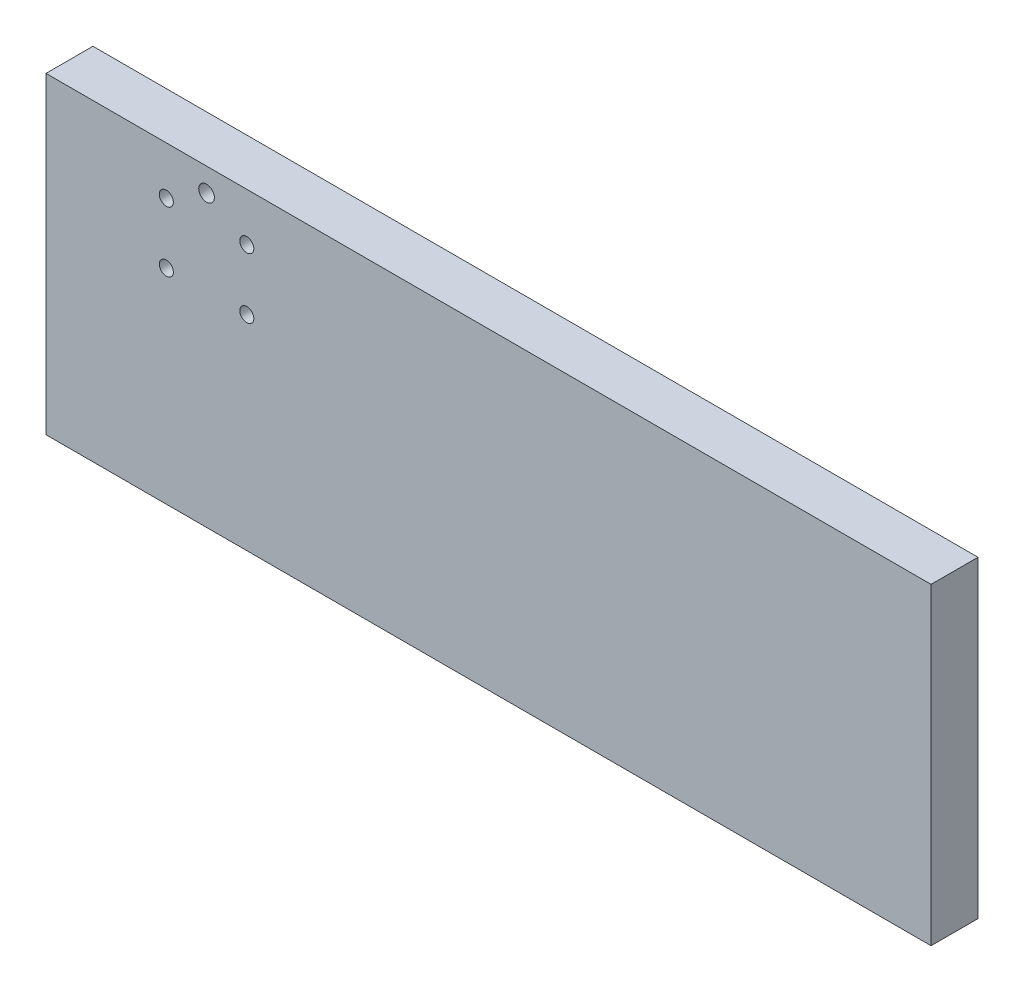
ISO-10303-21;
HEADER;
FILE_DESCRIPTION(('STEP AP214'),'2;1');
FILE_NAME('part.step','',(''),(''),'','','');
FILE_SCHEMA(('AUTOMOTIVE_DESIGN { 1 0 10303 214 1 1 1 1 }'));
ENDSEC;
DATA;
#1=APPLICATION_CONTEXT('core data for automotive mechanical design processes');
#2=APPLICATION_PROTOCOL_DEFINITION('international standard','automotive_design',2000,#1);
#3=PRODUCT_CONTEXT('',#1,'mechanical');
#4=PRODUCT('Part','Part','',(#3));
#5=PRODUCT_RELATED_PRODUCT_CATEGORY('part','',(#4));
#6=PRODUCT_DEFINITION_FORMATION('','',#4);
#7=PRODUCT_DEFINITION_CONTEXT('part definition',#1,'design');
#8=PRODUCT_DEFINITION('design','',#6,#7);
#9=PRODUCT_DEFINITION_SHAPE('','',#8);
#10=(LENGTH_UNIT() NAMED_UNIT(*) SI_UNIT(.MILLI.,.METRE.));
#11=(NAMED_UNIT(*) PLANE_ANGLE_UNIT() SI_UNIT($,.RADIAN.));
#12=(NAMED_UNIT(*) SI_UNIT($,.STERADIAN.) SOLID_ANGLE_UNIT());
#13=UNCERTAINTY_MEASURE_WITH_UNIT(LENGTH_MEASURE(1.E-05),#10,'distance_accuracy_value','');
#14=(GEOMETRIC_REPRESENTATION_CONTEXT(3) GLOBAL_UNCERTAINTY_ASSIGNED_CONTEXT((#13)) GLOBAL_UNIT_ASSIGNED_CONTEXT((#10,
#11,#12)) REPRESENTATION_CONTEXT('',''));
#15=CARTESIAN_POINT('',(0.,0.,0.));
#16=DIRECTION('',(0.,0.,1.));
#17=DIRECTION('',(1.,0.,0.));
#18=AXIS2_PLACEMENT_3D('',#15,#16,#17);
#19=CARTESIAN_POINT('',(0.,0.,19.05));
#20=DIRECTION('',(1.,0.,0.));
#21=DIRECTION('',(0.,0.,-1.));
#22=AXIS2_PLACEMENT_3D('',#19,#20,#21);
#23=PLANE('',#22);
#24=DIRECTION('',(0.,-1.,0.));
#25=VECTOR('',#24,1.);
#26=CARTESIAN_POINT('',(0.,0.,0.));
#27=LINE('',#26,#25);
#28=CARTESIAN_POINT('',(0.,127.,0.));
#29=VERTEX_POINT('',#28);
#30=CARTESIAN_POINT('',(0.,0.,0.));
#31=VERTEX_POINT('',#30);
#32=EDGE_CURVE('E96',#29,#31,#27,.T.);
#33=ORIENTED_EDGE('',*,*,#32,.T.);
#34=DIRECTION('',(0.,0.,-1.));
#35=VECTOR('',#34,1.);
#36=CARTESIAN_POINT('',(0.,0.,19.05));
#37=LINE('',#36,#35);
#38=CARTESIAN_POINT('',(0.,0.,19.05));
#39=VERTEX_POINT('',#38);
#40=EDGE_CURVE('E11',#39,#31,#37,.T.);
#41=ORIENTED_EDGE('',*,*,#40,.F.);
#42=DIRECTION('',(0.,-1.,0.));
#43=VECTOR('',#42,1.);
#44=CARTESIAN_POINT('',(0.,0.,19.05));
#45=LINE('',#44,#43);
#46=CARTESIAN_POINT('',(0.,127.,19.05));
#47=VERTEX_POINT('',#46);
#48=EDGE_CURVE('E84',#47,#39,#45,.T.);
#49=ORIENTED_EDGE('',*,*,#48,.F.);
#50=DIRECTION('',(0.,0.,-1.));
#51=VECTOR('',#50,1.);
#52=CARTESIAN_POINT('',(0.,127.,19.05));
#53=LINE('',#52,#51);
#54=EDGE_CURVE('E92',#47,#29,#53,.T.);
#55=ORIENTED_EDGE('',*,*,#54,.T.);
#56=EDGE_LOOP('',(#33,#41,#49,#55));
#57=FACE_BOUND('',#56,.T.);
#58=ADVANCED_FACE('F33',(#57),#23,.F.);
#59=CARTESIAN_POINT('',(0.,0.,19.05));
#60=DIRECTION('',(0.,1.,0.));
#61=DIRECTION('',(0.,0.,1.));
#62=AXIS2_PLACEMENT_3D('',#59,#60,#61);
#63=PLANE('',#62);
#64=DIRECTION('',(1.,0.,0.));
#65=VECTOR('',#64,1.);
#66=CARTESIAN_POINT('',(0.,0.,0.));
#67=LINE('',#66,#65);
#68=CARTESIAN_POINT('',(359.156,0.,0.));
#69=VERTEX_POINT('',#68);
#70=EDGE_CURVE('E88',#31,#69,#67,.T.);
#71=ORIENTED_EDGE('',*,*,#70,.T.);
#72=DIRECTION('',(0.,0.,-1.));
#73=VECTOR('',#72,1.);
#74=CARTESIAN_POINT('',(359.156,0.,19.05));
#75=LINE('',#74,#73);
#76=CARTESIAN_POINT('',(359.156,0.,19.05));
#77=VERTEX_POINT('',#76);
#78=EDGE_CURVE('E41',#77,#69,#75,.T.);
#79=ORIENTED_EDGE('',*,*,#78,.F.);
#80=DIRECTION('',(1.,0.,0.));
#81=VECTOR('',#80,1.);
#82=CARTESIAN_POINT('',(0.,0.,19.05));
#83=LINE('',#82,#81);
#84=EDGE_CURVE('E79',#39,#77,#83,.T.);
#85=ORIENTED_EDGE('',*,*,#84,.F.);
#86=ORIENTED_EDGE('',*,*,#40,.T.);
#87=EDGE_LOOP('',(#71,#79,#85,#86));
#88=FACE_BOUND('',#87,.T.);
#89=ADVANCED_FACE('F87',(#88),#63,.F.);
#90=CARTESIAN_POINT('',(359.156,0.,19.05));
#91=DIRECTION('',(-1.,0.,0.));
#92=DIRECTION('',(0.,0.,1.));
#93=AXIS2_PLACEMENT_3D('',#90,#91,#92);
#94=PLANE('',#93);
#95=DIRECTION('',(0.,1.,0.));
#96=VECTOR('',#95,1.);
#97=CARTESIAN_POINT('',(359.156,0.,0.));
#98=LINE('',#97,#96);
#99=CARTESIAN_POINT('',(359.156,127.,0.));
#100=VERTEX_POINT('',#99);
#101=EDGE_CURVE('E66',#69,#100,#98,.T.);
#102=ORIENTED_EDGE('',*,*,#101,.T.);
#103=DIRECTION('',(0.,0.,-1.));
#104=VECTOR('',#103,1.);
#105=CARTESIAN_POINT('',(359.156,127.,19.05));
#106=LINE('',#105,#104);
#107=CARTESIAN_POINT('',(359.156,127.,19.05));
#108=VERTEX_POINT('',#107);
#109=EDGE_CURVE('E89',#108,#100,#106,.T.);
#110=ORIENTED_EDGE('',*,*,#109,.F.);
#111=DIRECTION('',(0.,1.,0.));
#112=VECTOR('',#111,1.);
#113=CARTESIAN_POINT('',(359.156,0.,19.05));
#114=LINE('',#113,#112);
#115=EDGE_CURVE('E82',#77,#108,#114,.T.);
#116=ORIENTED_EDGE('',*,*,#115,.F.);
#117=ORIENTED_EDGE('',*,*,#78,.T.);
#118=EDGE_LOOP('',(#102,#110,#116,#117));
#119=FACE_BOUND('',#118,.T.);
#120=ADVANCED_FACE('F90',(#119),#94,.F.);
#121=CARTESIAN_POINT('',(0.,127.,19.05));
#122=DIRECTION('',(0.,-1.,0.));
#123=DIRECTION('',(0.,0.,-1.));
#124=AXIS2_PLACEMENT_3D('',#121,#122,#123);
#125=PLANE('',#124);
#126=DIRECTION('',(-1.,0.,0.));
#127=VECTOR('',#126,1.);
#128=CARTESIAN_POINT('',(0.,127.,0.));
#129=LINE('',#128,#127);
#130=EDGE_CURVE('E72',#100,#29,#129,.T.);
#131=ORIENTED_EDGE('',*,*,#130,.T.);
#132=ORIENTED_EDGE('',*,*,#54,.F.);
#133=DIRECTION('',(-1.,0.,0.));
#134=VECTOR('',#133,1.);
#135=CARTESIAN_POINT('',(0.,127.,19.05));
#136=LINE('',#135,#134);
#137=EDGE_CURVE('E49',#108,#47,#136,.T.);
#138=ORIENTED_EDGE('',*,*,#137,.F.);
#139=ORIENTED_EDGE('',*,*,#109,.T.);
#140=EDGE_LOOP('',(#131,#132,#138,#139));
#141=FACE_BOUND('',#140,.T.);
#142=ADVANCED_FACE('F104',(#141),#125,.F.);
#143=CARTESIAN_POINT('',(0.,0.,19.05));
#144=DIRECTION('',(0.,0.,-1.));
#145=DIRECTION('',(-1.,0.,0.));
#146=AXIS2_PLACEMENT_3D('',#143,#144,#145);
#147=PLANE('',#146);
#148=CARTESIAN_POINT('',(65.1510000000813,117.475000000113,19.05));
#149=DIRECTION('',(0.,0.,-1.));
#150=DIRECTION('',(-1.,0.,0.));
#151=AXIS2_PLACEMENT_3D('',#148,#149,#150);
#152=CIRCLE('',#151,3.175);
#153=CARTESIAN_POINT('',(61.9760000000813,117.475000000113,19.05));
#154=VERTEX_POINT('',#153);
#155=EDGE_CURVE('E134',#154,#154,#152,.T.);
#156=ORIENTED_EDGE('',*,*,#155,.T.);
#157=EDGE_LOOP('',(#156));
#158=FACE_BOUND('',#157,.T.);
#159=CARTESIAN_POINT('',(81.47685,82.9627499999999,19.05));
#160=DIRECTION('',(0.,0.,1.));
#161=DIRECTION('',(1.,0.,0.));
#162=AXIS2_PLACEMENT_3D('',#159,#160,#161);
#163=CIRCLE('',#162,2.85115);
#164=CARTESIAN_POINT('',(84.328,82.9627499999999,19.05));
#165=VERTEX_POINT('',#164);
#166=EDGE_CURVE('E119',#165,#165,#163,.T.);
#167=ORIENTED_EDGE('',*,*,#166,.F.);
#168=EDGE_LOOP('',(#167));
#169=FACE_BOUND('',#168,.T.);
#170=CARTESIAN_POINT('',(81.47685,107.53725,19.05));
#171=DIRECTION('',(0.,0.,1.));
#172=DIRECTION('',(1.,0.,0.));
#173=AXIS2_PLACEMENT_3D('',#170,#171,#172);
#174=CIRCLE('',#173,2.85115);
#175=CARTESIAN_POINT('',(84.328,107.53725,19.05));
#176=VERTEX_POINT('',#175);
#177=EDGE_CURVE('E126',#176,#176,#174,.T.);
#178=ORIENTED_EDGE('',*,*,#177,.F.);
#179=EDGE_LOOP('',(#178));
#180=FACE_BOUND('',#179,.T.);
#181=CARTESIAN_POINT('',(48.82515,107.53725,19.05));
#182=DIRECTION('',(0.,0.,1.));
#183=DIRECTION('',(1.,0.,0.));
#184=AXIS2_PLACEMENT_3D('',#181,#182,#183);
#185=CIRCLE('',#184,2.85115);
#186=CARTESIAN_POINT('',(51.6763,107.53725,19.05));
#187=VERTEX_POINT('',#186);
#188=EDGE_CURVE('E113',#187,#187,#185,.T.);
#189=ORIENTED_EDGE('',*,*,#188,.F.);
#190=EDGE_LOOP('',(#189));
#191=FACE_BOUND('',#190,.T.);
#192=CARTESIAN_POINT('',(48.82515,82.96275,19.05));
#193=DIRECTION('',(0.,0.,1.));
#194=DIRECTION('',(1.,0.,0.));
#195=AXIS2_PLACEMENT_3D('',#192,#193,#194);
#196=CIRCLE('',#195,2.85115);
#197=CARTESIAN_POINT('',(51.6763,82.96275,19.05));
#198=VERTEX_POINT('',#197);
#199=EDGE_CURVE('E99',#198,#198,#196,.T.);
#200=ORIENTED_EDGE('',*,*,#199,.F.);
#201=EDGE_LOOP('',(#200));
#202=FACE_BOUND('',#201,.T.);
#203=ORIENTED_EDGE('',*,*,#48,.T.);
#204=ORIENTED_EDGE('',*,*,#84,.T.);
#205=ORIENTED_EDGE('',*,*,#115,.T.);
#206=ORIENTED_EDGE('',*,*,#137,.T.);
#207=EDGE_LOOP('',(#203,#204,#205,#206));
#208=FACE_BOUND('',#207,.T.);
#209=ADVANCED_FACE('F80',(#158,#169,#180,#191,#202,#208),#147,.F.);
#210=CARTESIAN_POINT('',(0.,0.,0.));
#211=DIRECTION('',(0.,0.,-1.));
#212=DIRECTION('',(-1.,0.,0.));
#213=AXIS2_PLACEMENT_3D('',#210,#211,#212);
#214=PLANE('',#213);
#215=CARTESIAN_POINT('',(81.47685,82.9627499999999,0.));
#216=DIRECTION('',(0.,0.,-1.));
#217=DIRECTION('',(-1.,0.,0.));
#218=AXIS2_PLACEMENT_3D('',#215,#216,#217);
#219=CIRCLE('',#218,2.85115);
#220=CARTESIAN_POINT('',(78.6257,82.9627499999999,0.));
#221=VERTEX_POINT('',#220);
#222=EDGE_CURVE('E116',#221,#221,#219,.F.);
#223=ORIENTED_EDGE('',*,*,#222,.T.);
#224=EDGE_LOOP('',(#223));
#225=FACE_BOUND('',#224,.T.);
#226=CARTESIAN_POINT('',(81.47685,107.53725,0.));
#227=DIRECTION('',(0.,0.,-1.));
#228=DIRECTION('',(-1.,0.,0.));
#229=AXIS2_PLACEMENT_3D('',#226,#227,#228);
#230=CIRCLE('',#229,2.85115);
#231=CARTESIAN_POINT('',(78.6257,107.53725,0.));
#232=VERTEX_POINT('',#231);
#233=EDGE_CURVE('E123',#232,#232,#230,.F.);
#234=ORIENTED_EDGE('',*,*,#233,.T.);
#235=EDGE_LOOP('',(#234));
#236=FACE_BOUND('',#235,.T.);
#237=CARTESIAN_POINT('',(48.82515,107.53725,0.));
#238=DIRECTION('',(0.,0.,-1.));
#239=DIRECTION('',(-1.,0.,0.));
#240=AXIS2_PLACEMENT_3D('',#237,#238,#239);
#241=CIRCLE('',#240,2.85115);
#242=CARTESIAN_POINT('',(45.974,107.53725,0.));
#243=VERTEX_POINT('',#242);
#244=EDGE_CURVE('E129',#243,#243,#241,.F.);
#245=ORIENTED_EDGE('',*,*,#244,.T.);
#246=EDGE_LOOP('',(#245));
#247=FACE_BOUND('',#246,.T.);
#248=CARTESIAN_POINT('',(48.82515,82.96275,0.));
#249=DIRECTION('',(0.,0.,-1.));
#250=DIRECTION('',(-1.,0.,0.));
#251=AXIS2_PLACEMENT_3D('',#248,#249,#250);
#252=CIRCLE('',#251,2.85115);
#253=CARTESIAN_POINT('',(45.974,82.96275,0.));
#254=VERTEX_POINT('',#253);
#255=EDGE_CURVE('E110',#254,#254,#252,.F.);
#256=ORIENTED_EDGE('',*,*,#255,.T.);
#257=EDGE_LOOP('',(#256));
#258=FACE_BOUND('',#257,.T.);
#259=ORIENTED_EDGE('',*,*,#32,.F.);
#260=ORIENTED_EDGE('',*,*,#130,.F.);
#261=ORIENTED_EDGE('',*,*,#101,.F.);
#262=ORIENTED_EDGE('',*,*,#70,.F.);
#263=EDGE_LOOP('',(#259,#260,#261,#262));
#264=FACE_BOUND('',#263,.T.);
#265=ADVANCED_FACE('F107',(#225,#236,#247,#258,#264),#214,.T.);
#266=CARTESIAN_POINT('',(48.82515,82.96275,-0.001000000000001));
#267=DIRECTION('',(0.,0.,1.));
#268=DIRECTION('',(1.,0.,0.));
#269=AXIS2_PLACEMENT_3D('',#266,#267,#268);
#270=CYLINDRICAL_SURFACE('',#269,2.85115);
#271=ORIENTED_EDGE('',*,*,#255,.F.);
#272=EDGE_LOOP('',(#271));
#273=FACE_BOUND('',#272,.T.);
#274=ORIENTED_EDGE('',*,*,#199,.T.);
#275=EDGE_LOOP('',(#274));
#276=FACE_BOUND('',#275,.T.);
#277=ADVANCED_FACE('F164',(#273,#276),#270,.F.);
#278=CARTESIAN_POINT('',(48.82515,107.53725,-0.001000000000001));
#279=DIRECTION('',(0.,0.,1.));
#280=DIRECTION('',(1.,0.,0.));
#281=AXIS2_PLACEMENT_3D('',#278,#279,#280);
#282=CYLINDRICAL_SURFACE('',#281,2.85115);
#283=ORIENTED_EDGE('',*,*,#244,.F.);
#284=EDGE_LOOP('',(#283));
#285=FACE_BOUND('',#284,.T.);
#286=ORIENTED_EDGE('',*,*,#188,.T.);
#287=EDGE_LOOP('',(#286));
#288=FACE_BOUND('',#287,.T.);
#289=ADVANCED_FACE('F171',(#285,#288),#282,.F.);
#290=CARTESIAN_POINT('',(81.47685,107.53725,-0.001000000000001));
#291=DIRECTION('',(0.,0.,1.));
#292=DIRECTION('',(1.,0.,0.));
#293=AXIS2_PLACEMENT_3D('',#290,#291,#292);
#294=CYLINDRICAL_SURFACE('',#293,2.85115);
#295=ORIENTED_EDGE('',*,*,#233,.F.);
#296=EDGE_LOOP('',(#295));
#297=FACE_BOUND('',#296,.T.);
#298=ORIENTED_EDGE('',*,*,#177,.T.);
#299=EDGE_LOOP('',(#298));
#300=FACE_BOUND('',#299,.T.);
#301=ADVANCED_FACE('F175',(#297,#300),#294,.F.);
#302=CARTESIAN_POINT('',(81.47685,82.9627499999999,-0.001000000000001));
#303=DIRECTION('',(0.,0.,1.));
#304=DIRECTION('',(1.,0.,0.));
#305=AXIS2_PLACEMENT_3D('',#302,#303,#304);
#306=CYLINDRICAL_SURFACE('',#305,2.85115);
#307=ORIENTED_EDGE('',*,*,#222,.F.);
#308=EDGE_LOOP('',(#307));
#309=FACE_BOUND('',#308,.T.);
#310=ORIENTED_EDGE('',*,*,#166,.T.);
#311=EDGE_LOOP('',(#310));
#312=FACE_BOUND('',#311,.T.);
#313=ADVANCED_FACE('F149',(#309,#312),#306,.F.);
#314=CARTESIAN_POINT('',(65.1510000000813,117.475000000113,12.7));
#315=DIRECTION('',(0.,0.,1.));
#316=DIRECTION('',(1.,0.,0.));
#317=AXIS2_PLACEMENT_3D('',#314,#315,#316);
#318=CYLINDRICAL_SURFACE('',#317,3.175);
#319=CARTESIAN_POINT('',(65.1510000000813,117.475000000113,12.7));
#320=DIRECTION('',(0.,0.,-1.));
#321=DIRECTION('',(-1.,0.,0.));
#322=AXIS2_PLACEMENT_3D('',#319,#320,#321);
#323=CIRCLE('',#322,3.175);
#324=CARTESIAN_POINT('',(61.9760000000813,117.475000000113,12.7));
#325=VERTEX_POINT('',#324);
#326=EDGE_CURVE('E120',#325,#325,#323,.T.);
#327=ORIENTED_EDGE('',*,*,#326,.T.);
#328=EDGE_LOOP('',(#327));
#329=FACE_BOUND('',#328,.T.);
#330=ORIENTED_EDGE('',*,*,#155,.F.);
#331=EDGE_LOOP('',(#330));
#332=FACE_BOUND('',#331,.T.);
#333=ADVANCED_FACE('F140',(#329,#332),#318,.F.);
#334=CARTESIAN_POINT('',(65.1510000000813,117.475000000113,12.7));
#335=DIRECTION('',(0.,0.,-1.));
#336=DIRECTION('',(-1.,0.,0.));
#337=AXIS2_PLACEMENT_3D('',#334,#335,#336);
#338=PLANE('',#337);
#339=ORIENTED_EDGE('',*,*,#326,.F.);
#340=EDGE_LOOP('',(#339));
#341=FACE_BOUND('',#340,.T.);
#342=ADVANCED_FACE('F143',(#341),#338,.F.);
#343=CLOSED_SHELL('',(#58,#89,#120,#142,#209,#265,#277,#289,#301,#313,#333,#342));
#344=MANIFOLD_SOLID_BREP('B2',#343);
#345=ADVANCED_BREP_SHAPE_REPRESENTATION('',(#18,#344),#14);
#346=SHAPE_DEFINITION_REPRESENTATION(#9,#345);
ENDSEC;
END-ISO-10303-21;
